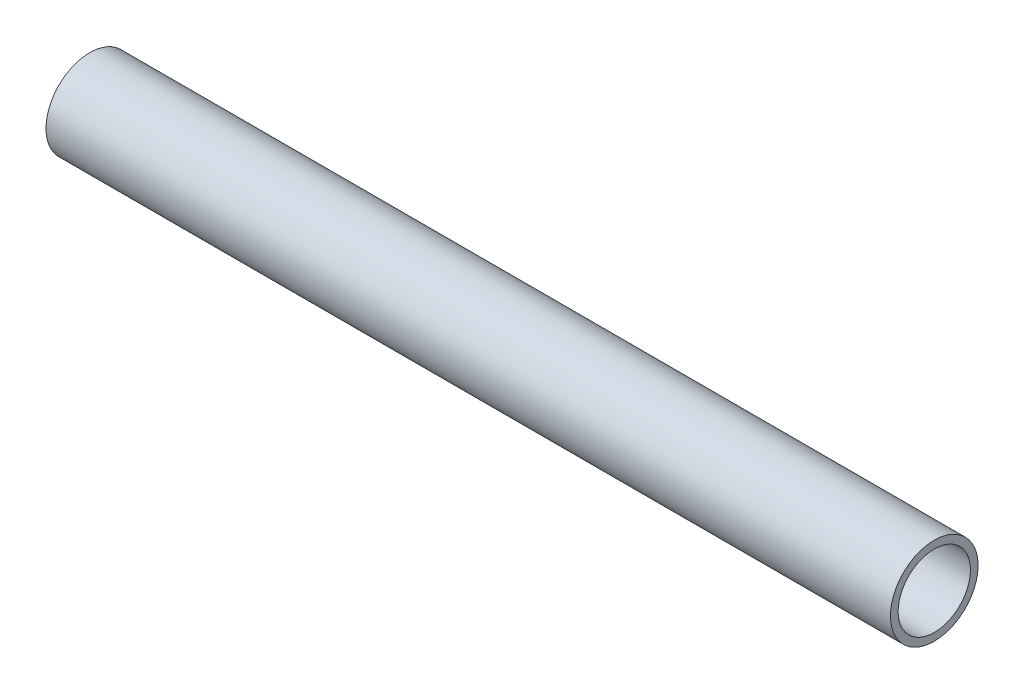
ISO-10303-21;
HEADER;
FILE_DESCRIPTION(('STEP AP214'),'2;1');
FILE_NAME('part.step','',(''),(''),'','','');
FILE_SCHEMA(('AUTOMOTIVE_DESIGN { 1 0 10303 214 1 1 1 1 }'));
ENDSEC;
DATA;
#1=APPLICATION_CONTEXT('core data for automotive mechanical design processes');
#2=APPLICATION_PROTOCOL_DEFINITION('international standard','automotive_design',2000,#1);
#3=PRODUCT_CONTEXT('',#1,'mechanical');
#4=PRODUCT('Part','Part','',(#3));
#5=PRODUCT_RELATED_PRODUCT_CATEGORY('part','',(#4));
#6=PRODUCT_DEFINITION_FORMATION('','',#4);
#7=PRODUCT_DEFINITION_CONTEXT('part definition',#1,'design');
#8=PRODUCT_DEFINITION('design','',#6,#7);
#9=PRODUCT_DEFINITION_SHAPE('','',#8);
#10=(LENGTH_UNIT() NAMED_UNIT(*) SI_UNIT(.MILLI.,.METRE.));
#11=(NAMED_UNIT(*) PLANE_ANGLE_UNIT() SI_UNIT($,.RADIAN.));
#12=(NAMED_UNIT(*) SI_UNIT($,.STERADIAN.) SOLID_ANGLE_UNIT());
#13=UNCERTAINTY_MEASURE_WITH_UNIT(LENGTH_MEASURE(1.E-05),#10,'distance_accuracy_value','');
#14=(GEOMETRIC_REPRESENTATION_CONTEXT(3) GLOBAL_UNCERTAINTY_ASSIGNED_CONTEXT((#13)) GLOBAL_UNIT_ASSIGNED_CONTEXT((#10,
#11,#12)) REPRESENTATION_CONTEXT('',''));
#15=CARTESIAN_POINT('',(0.,0.,0.));
#16=DIRECTION('',(0.,0.,1.));
#17=DIRECTION('',(1.,0.,0.));
#18=AXIS2_PLACEMENT_3D('',#15,#16,#17);
#19=CARTESIAN_POINT('',(0.,21.082,0.));
#20=DIRECTION('',(1.,0.,0.));
#21=DIRECTION('',(0.,0.,-1.));
#22=AXIS2_PLACEMENT_3D('',#19,#20,#21);
#23=PLANE('',#22);
#24=CARTESIAN_POINT('',(0.,0.,0.));
#25=DIRECTION('',(-1.,0.,0.));
#26=DIRECTION('',(0.,0.,1.));
#27=AXIS2_PLACEMENT_3D('',#24,#25,#26);
#28=CIRCLE('',#27,17.399);
#29=CARTESIAN_POINT('',(0.,0.,17.399));
#30=VERTEX_POINT('',#29);
#31=EDGE_CURVE('E10',#30,#30,#28,.T.);
#32=ORIENTED_EDGE('',*,*,#31,.F.);
#33=EDGE_LOOP('',(#32));
#34=FACE_BOUND('',#33,.T.);
#35=CARTESIAN_POINT('',(0.,0.,0.));
#36=DIRECTION('',(-1.,0.,0.));
#37=DIRECTION('',(0.,0.,1.));
#38=AXIS2_PLACEMENT_3D('',#35,#36,#37);
#39=CIRCLE('',#38,21.082);
#40=CARTESIAN_POINT('',(0.,0.,21.082));
#41=VERTEX_POINT('',#40);
#42=EDGE_CURVE('E45',#41,#41,#39,.T.);
#43=ORIENTED_EDGE('',*,*,#42,.T.);
#44=EDGE_LOOP('',(#43));
#45=FACE_BOUND('',#44,.T.);
#46=ADVANCED_FACE('F31',(#34,#45),#23,.F.);
#47=CARTESIAN_POINT('',(-17.1381189915806,0.,0.));
#48=DIRECTION('',(-1.,0.,0.));
#49=DIRECTION('',(0.,0.,1.));
#50=AXIS2_PLACEMENT_3D('',#47,#48,#49);
#51=CYLINDRICAL_SURFACE('',#50,17.399);
#52=CARTESIAN_POINT('',(406.4,0.,0.));
#53=DIRECTION('',(-1.,0.,0.));
#54=DIRECTION('',(0.,0.,1.));
#55=AXIS2_PLACEMENT_3D('',#52,#53,#54);
#56=CIRCLE('',#55,17.399);
#57=CARTESIAN_POINT('',(406.4,0.,17.399));
#58=VERTEX_POINT('',#57);
#59=EDGE_CURVE('E37',#58,#58,#56,.T.);
#60=ORIENTED_EDGE('',*,*,#59,.F.);
#61=EDGE_LOOP('',(#60));
#62=FACE_BOUND('',#61,.T.);
#63=ORIENTED_EDGE('',*,*,#31,.T.);
#64=EDGE_LOOP('',(#63));
#65=FACE_BOUND('',#64,.T.);
#66=ADVANCED_FACE('F60',(#62,#65),#51,.F.);
#67=CARTESIAN_POINT('',(406.4,21.082,0.));
#68=DIRECTION('',(-1.,0.,0.));
#69=DIRECTION('',(0.,0.,1.));
#70=AXIS2_PLACEMENT_3D('',#67,#68,#69);
#71=PLANE('',#70);
#72=CARTESIAN_POINT('',(406.4,0.,0.));
#73=DIRECTION('',(-1.,0.,0.));
#74=DIRECTION('',(0.,0.,1.));
#75=AXIS2_PLACEMENT_3D('',#72,#73,#74);
#76=CIRCLE('',#75,21.082);
#77=CARTESIAN_POINT('',(406.4,0.,21.082));
#78=VERTEX_POINT('',#77);
#79=EDGE_CURVE('E41',#78,#78,#76,.T.);
#80=ORIENTED_EDGE('',*,*,#79,.F.);
#81=EDGE_LOOP('',(#80));
#82=FACE_BOUND('',#81,.T.);
#83=ORIENTED_EDGE('',*,*,#59,.T.);
#84=EDGE_LOOP('',(#83));
#85=FACE_BOUND('',#84,.T.);
#86=ADVANCED_FACE('F55',(#82,#85),#71,.F.);
#87=CARTESIAN_POINT('',(-17.1381189915806,0.,0.));
#88=DIRECTION('',(-1.,0.,0.));
#89=DIRECTION('',(0.,0.,1.));
#90=AXIS2_PLACEMENT_3D('',#87,#88,#89);
#91=CYLINDRICAL_SURFACE('',#90,21.082);
#92=ORIENTED_EDGE('',*,*,#42,.F.);
#93=EDGE_LOOP('',(#92));
#94=FACE_BOUND('',#93,.T.);
#95=ORIENTED_EDGE('',*,*,#79,.T.);
#96=EDGE_LOOP('',(#95));
#97=FACE_BOUND('',#96,.T.);
#98=ADVANCED_FACE('F52',(#94,#97),#91,.T.);
#99=CLOSED_SHELL('',(#46,#66,#86,#98));
#100=MANIFOLD_SOLID_BREP('B2',#99);
#101=ADVANCED_BREP_SHAPE_REPRESENTATION('',(#18,#100),#14);
#102=SHAPE_DEFINITION_REPRESENTATION(#9,#101);
ENDSEC;
END-ISO-10303-21;
